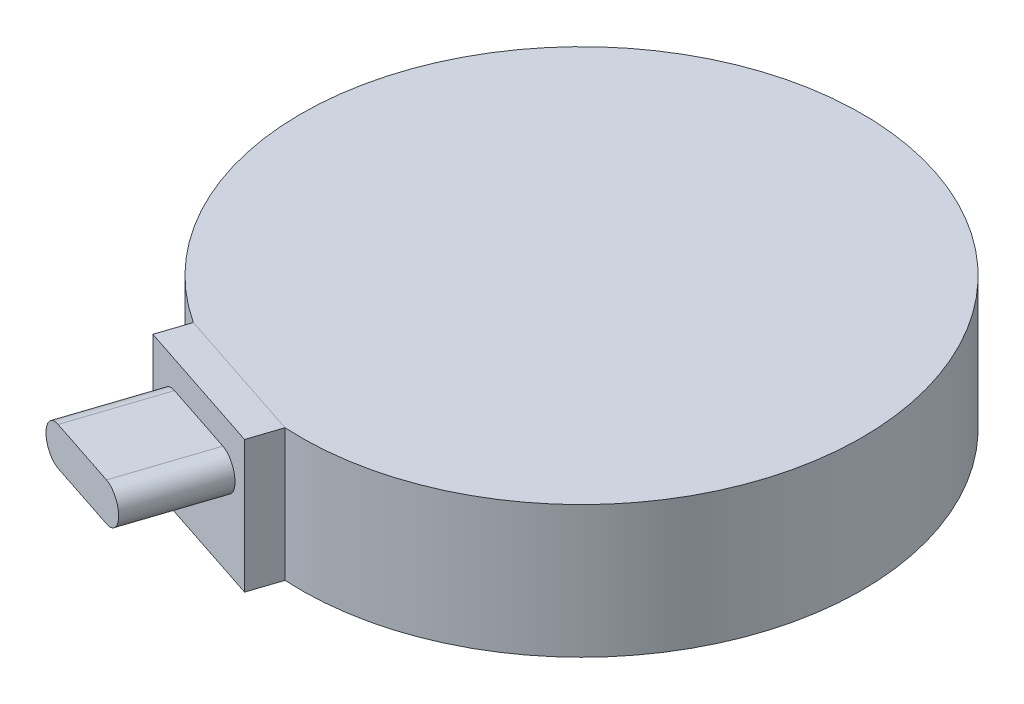
ISO-10303-21;
HEADER;
FILE_DESCRIPTION(('STEP AP214'),'2;1');
FILE_NAME('part.step','',(''),(''),'','','');
FILE_SCHEMA(('AUTOMOTIVE_DESIGN { 1 0 10303 214 1 1 1 1 }'));
ENDSEC;
DATA;
#1=APPLICATION_CONTEXT('core data for automotive mechanical design processes');
#2=APPLICATION_PROTOCOL_DEFINITION('international standard','automotive_design',2000,#1);
#3=PRODUCT_CONTEXT('',#1,'mechanical');
#4=PRODUCT('Part','Part','',(#3));
#5=PRODUCT_RELATED_PRODUCT_CATEGORY('part','',(#4));
#6=PRODUCT_DEFINITION_FORMATION('','',#4);
#7=PRODUCT_DEFINITION_CONTEXT('part definition',#1,'design');
#8=PRODUCT_DEFINITION('design','',#6,#7);
#9=PRODUCT_DEFINITION_SHAPE('','',#8);
#10=(LENGTH_UNIT() NAMED_UNIT(*) SI_UNIT(.MILLI.,.METRE.));
#11=(NAMED_UNIT(*) PLANE_ANGLE_UNIT() SI_UNIT($,.RADIAN.));
#12=(NAMED_UNIT(*) SI_UNIT($,.STERADIAN.) SOLID_ANGLE_UNIT());
#13=UNCERTAINTY_MEASURE_WITH_UNIT(LENGTH_MEASURE(1.E-05),#10,'distance_accuracy_value','');
#14=(GEOMETRIC_REPRESENTATION_CONTEXT(3) GLOBAL_UNCERTAINTY_ASSIGNED_CONTEXT((#13)) GLOBAL_UNIT_ASSIGNED_CONTEXT((#10,
#11,#12)) REPRESENTATION_CONTEXT('',''));
#15=CARTESIAN_POINT('',(0.,0.,0.));
#16=DIRECTION('',(0.,0.,1.));
#17=DIRECTION('',(1.,0.,0.));
#18=AXIS2_PLACEMENT_3D('',#15,#16,#17);
#19=CARTESIAN_POINT('',(0.,33.,0.));
#20=DIRECTION('',(0.,-1.,0.));
#21=DIRECTION('',(0.,0.,-1.));
#22=AXIS2_PLACEMENT_3D('',#19,#20,#21);
#23=CYLINDRICAL_SURFACE('',#22,70.);
#24=DIRECTION('',(0.,-1.,0.));
#25=VECTOR('',#24,1.);
#26=CARTESIAN_POINT('',(-38.3128914110618,0.,58.5843183089485));
#27=LINE('',#26,#25);
#28=CARTESIAN_POINT('',(-38.3128914110618,33.,58.5843183089485));
#29=VERTEX_POINT('',#28);
#30=CARTESIAN_POINT('',(-38.3128914110618,0.,58.5843183089485));
#31=VERTEX_POINT('',#30);
#32=EDGE_CURVE('E159',#29,#31,#27,.T.);
#33=ORIENTED_EDGE('',*,*,#32,.F.);
#34=CARTESIAN_POINT('',(0.,33.,0.));
#35=DIRECTION('',(0.,1.,0.));
#36=DIRECTION('',(0.,0.,1.));
#37=AXIS2_PLACEMENT_3D('',#34,#35,#36);
#38=CIRCLE('',#37,70.);
#39=CARTESIAN_POINT('',(-4.13026741874176,33.,69.8780429823967));
#40=VERTEX_POINT('',#39);
#41=EDGE_CURVE('E176',#40,#29,#38,.T.);
#42=ORIENTED_EDGE('',*,*,#41,.F.);
#43=DIRECTION('',(0.,1.,0.));
#44=VECTOR('',#43,1.);
#45=CARTESIAN_POINT('',(-4.13026741874154,0.,69.8780429823967));
#46=LINE('',#45,#44);
#47=CARTESIAN_POINT('',(-4.13026741874154,0.,69.8780429823967));
#48=VERTEX_POINT('',#47);
#49=EDGE_CURVE('E155',#48,#40,#46,.T.);
#50=ORIENTED_EDGE('',*,*,#49,.F.);
#51=CARTESIAN_POINT('',(0.,0.,0.));
#52=DIRECTION('',(0.,1.,0.));
#53=DIRECTION('',(0.,0.,1.));
#54=AXIS2_PLACEMENT_3D('',#51,#52,#53);
#55=CIRCLE('',#54,70.);
#56=EDGE_CURVE('E175',#48,#31,#55,.T.);
#57=ORIENTED_EDGE('',*,*,#56,.T.);
#58=EDGE_LOOP('',(#33,#42,#50,#57));
#59=FACE_BOUND('',#58,.T.);
#60=ADVANCED_FACE('F34',(#59),#23,.T.);
#61=CARTESIAN_POINT('',(0.,33.,0.));
#62=DIRECTION('',(0.,1.,0.));
#63=DIRECTION('',(0.,0.,1.));
#64=AXIS2_PLACEMENT_3D('',#61,#62,#63);
#65=PLANE('',#64);
#66=ORIENTED_EDGE('',*,*,#41,.T.);
#67=DIRECTION('',(0.949517333120006,0.,0.313714574262452));
#68=VECTOR('',#67,1.);
#69=CARTESIAN_POINT('',(-21.2215794149017,33.,64.2311806456726));
#70=LINE('',#69,#68);
#71=EDGE_CURVE('E172',#29,#40,#70,.T.);
#72=ORIENTED_EDGE('',*,*,#71,.T.);
#73=EDGE_LOOP('',(#66,#72));
#74=FACE_BOUND('',#73,.T.);
#75=ADVANCED_FACE('F196',(#74),#65,.T.);
#76=CARTESIAN_POINT('',(0.,0.,0.));
#77=DIRECTION('',(0.,1.,0.));
#78=DIRECTION('',(0.,0.,1.));
#79=AXIS2_PLACEMENT_3D('',#76,#77,#78);
#80=PLANE('',#79);
#81=CARTESIAN_POINT('',(0.,0.,0.));
#82=DIRECTION('',(0.,1.,0.));
#83=DIRECTION('',(0.,0.,1.));
#84=AXIS2_PLACEMENT_3D('',#81,#82,#83);
#85=CIRCLE('',#84,19.3500000000001);
#86=CARTESIAN_POINT('',(0.,0.,19.3500000000001));
#87=VERTEX_POINT('',#86);
#88=EDGE_CURVE('E11',#87,#87,#85,.T.);
#89=ORIENTED_EDGE('',*,*,#88,.T.);
#90=EDGE_LOOP('',(#89));
#91=FACE_BOUND('',#90,.T.);
#92=ORIENTED_EDGE('',*,*,#56,.F.);
#93=DIRECTION('',(0.313714574262452,0.,-0.949517333120006));
#94=VECTOR('',#93,1.);
#95=CARTESIAN_POINT('',(-6.63998401284116,0.,77.4741816473568));
#96=LINE('',#95,#94);
#97=CARTESIAN_POINT('',(-6.63998401284116,0.,77.4741816473568));
#98=VERTEX_POINT('',#97);
#99=EDGE_CURVE('E154',#98,#48,#96,.T.);
#100=ORIENTED_EDGE('',*,*,#99,.F.);
#101=DIRECTION('',(0.949517333120006,0.,0.313714574262452));
#102=VECTOR('',#101,1.);
#103=CARTESIAN_POINT('',(-6.63998401284116,0.,77.4741816473568));
#104=LINE('',#103,#102);
#105=CARTESIAN_POINT('',(-40.8226080051614,0.,66.1804569739085));
#106=VERTEX_POINT('',#105);
#107=EDGE_CURVE('E152',#106,#98,#104,.T.);
#108=ORIENTED_EDGE('',*,*,#107,.F.);
#109=DIRECTION('',(0.313714574262452,0.,-0.949517333120006));
#110=VECTOR('',#109,1.);
#111=CARTESIAN_POINT('',(-40.8226080051614,0.,66.1804569739085));
#112=LINE('',#111,#110);
#113=EDGE_CURVE('E163',#106,#31,#112,.T.);
#114=ORIENTED_EDGE('',*,*,#113,.T.);
#115=EDGE_LOOP('',(#92,#100,#108,#114));
#116=FACE_BOUND('',#115,.T.);
#117=ADVANCED_FACE('F201',(#91,#116),#80,.F.);
#118=CARTESIAN_POINT('',(-6.63998401284116,0.,77.4741816473568));
#119=DIRECTION('',(-0.949517333120006,0.,-0.313714574262452));
#120=DIRECTION('',(-0.313714574262452,0.,0.949517333120006));
#121=AXIS2_PLACEMENT_3D('',#118,#119,#120);
#122=PLANE('',#121);
#123=ORIENTED_EDGE('',*,*,#49,.T.);
#124=CARTESIAN_POINT('',(-4.13026741874154,33.0033905467975,69.8780429823967));
#125=VERTEX_POINT('',#124);
#126=EDGE_CURVE('E139',#40,#125,#46,.T.);
#127=ORIENTED_EDGE('',*,*,#126,.T.);
#128=DIRECTION('',(0.313714574262452,0.,-0.949517333120006));
#129=VECTOR('',#128,1.);
#130=CARTESIAN_POINT('',(-6.63998401284116,33.0033905467975,77.4741816473568));
#131=LINE('',#130,#129);
#132=CARTESIAN_POINT('',(-6.63998401284116,33.0033905467975,77.4741816473568));
#133=VERTEX_POINT('',#132);
#134=EDGE_CURVE('E169',#133,#125,#131,.T.);
#135=ORIENTED_EDGE('',*,*,#134,.F.);
#136=DIRECTION('',(0.,1.,0.));
#137=VECTOR('',#136,1.);
#138=CARTESIAN_POINT('',(-6.63998401284116,0.,77.4741816473568));
#139=LINE('',#138,#137);
#140=EDGE_CURVE('E144',#98,#133,#139,.T.);
#141=ORIENTED_EDGE('',*,*,#140,.F.);
#142=ORIENTED_EDGE('',*,*,#99,.T.);
#143=EDGE_LOOP('',(#123,#127,#135,#141,#142));
#144=FACE_BOUND('',#143,.T.);
#145=ADVANCED_FACE('F207',(#144),#122,.F.);
#146=CARTESIAN_POINT('',(-6.63998401284116,33.0033905467975,77.4741816473568));
#147=DIRECTION('',(0.,-1.,0.));
#148=DIRECTION('',(0.,0.,-1.));
#149=AXIS2_PLACEMENT_3D('',#146,#147,#148);
#150=PLANE('',#149);
#151=DIRECTION('',(-0.949517333120006,0.,-0.313714574262452));
#152=VECTOR('',#151,1.);
#153=CARTESIAN_POINT('',(-4.13026741874154,33.0033905467975,69.8780429823967));
#154=LINE('',#153,#152);
#155=CARTESIAN_POINT('',(-38.3128914110618,33.0033905467975,58.5843183089485));
#156=VERTEX_POINT('',#155);
#157=EDGE_CURVE('E157',#125,#156,#154,.T.);
#158=ORIENTED_EDGE('',*,*,#157,.T.);
#159=DIRECTION('',(0.313714574262452,0.,-0.949517333120006));
#160=VECTOR('',#159,1.);
#161=CARTESIAN_POINT('',(-40.8226080051614,33.0033905467975,66.1804569739085));
#162=LINE('',#161,#160);
#163=CARTESIAN_POINT('',(-40.8226080051614,33.0033905467975,66.1804569739085));
#164=VERTEX_POINT('',#163);
#165=EDGE_CURVE('E166',#164,#156,#162,.T.);
#166=ORIENTED_EDGE('',*,*,#165,.F.);
#167=DIRECTION('',(-0.949517333120006,0.,-0.313714574262452));
#168=VECTOR('',#167,1.);
#169=CARTESIAN_POINT('',(-6.63998401284116,33.0033905467975,77.4741816473568));
#170=LINE('',#169,#168);
#171=EDGE_CURVE('E147',#133,#164,#170,.T.);
#172=ORIENTED_EDGE('',*,*,#171,.F.);
#173=ORIENTED_EDGE('',*,*,#134,.T.);
#174=EDGE_LOOP('',(#158,#166,#172,#173));
#175=FACE_BOUND('',#174,.T.);
#176=ADVANCED_FACE('F212',(#175),#150,.F.);
#177=CARTESIAN_POINT('',(-40.8226080051614,0.,66.1804569739085));
#178=DIRECTION('',(0.949517333120006,0.,0.313714574262452));
#179=DIRECTION('',(0.313714574262452,0.,-0.949517333120006));
#180=AXIS2_PLACEMENT_3D('',#177,#178,#179);
#181=PLANE('',#180);
#182=EDGE_CURVE('E148',#156,#29,#27,.T.);
#183=ORIENTED_EDGE('',*,*,#182,.T.);
#184=ORIENTED_EDGE('',*,*,#32,.T.);
#185=ORIENTED_EDGE('',*,*,#113,.F.);
#186=DIRECTION('',(0.,-1.,0.));
#187=VECTOR('',#186,1.);
#188=CARTESIAN_POINT('',(-40.8226080051614,0.,66.1804569739085));
#189=LINE('',#188,#187);
#190=EDGE_CURVE('E150',#164,#106,#189,.T.);
#191=ORIENTED_EDGE('',*,*,#190,.F.);
#192=ORIENTED_EDGE('',*,*,#165,.T.);
#193=EDGE_LOOP('',(#183,#184,#185,#191,#192));
#194=FACE_BOUND('',#193,.T.);
#195=ADVANCED_FACE('F216',(#194),#181,.F.);
#196=CARTESIAN_POINT('',(-23.7312960090013,0.,71.8273193106327));
#197=DIRECTION('',(-0.313714574262452,0.,0.949517333120006));
#198=DIRECTION('',(0.949517333120006,0.,0.313714574262452));
#199=AXIS2_PLACEMENT_3D('',#196,#197,#198);
#200=PLANE('',#199);
#201=CARTESIAN_POINT('',(-32.7517106736414,21.45,68.8470308551394));
#202=DIRECTION('',(0.313714574262452,0.,-0.949517333120006));
#203=DIRECTION('',(-0.949517333120006,0.,-0.313714574262452));
#204=AXIS2_PLACEMENT_3D('',#201,#202,#203);
#205=CIRCLE('',#204,4.75);
#206=CARTESIAN_POINT('',(-32.7517106736412,16.7,68.8470308551394));
#207=VERTEX_POINT('',#206);
#208=CARTESIAN_POINT('',(-32.7517106736414,26.2,68.8470308551394));
#209=VERTEX_POINT('',#208);
#210=EDGE_CURVE('E134',#207,#209,#205,.T.);
#211=ORIENTED_EDGE('',*,*,#210,.T.);
#212=DIRECTION('',(0.949517333120006,0.,0.313714574262452));
#213=VECTOR('',#212,1.);
#214=CARTESIAN_POINT('',(-32.7517106736414,26.2,68.8470308551394));
#215=LINE('',#214,#213);
#216=CARTESIAN_POINT('',(-14.7108813443612,26.2,74.807607766126));
#217=VERTEX_POINT('',#216);
#218=EDGE_CURVE('E109',#209,#217,#215,.T.);
#219=ORIENTED_EDGE('',*,*,#218,.T.);
#220=CARTESIAN_POINT('',(-14.7108813443612,21.45,74.807607766126));
#221=DIRECTION('',(-0.313714574262452,0.,0.949517333120006));
#222=DIRECTION('',(0.949517333120006,0.,0.313714574262452));
#223=AXIS2_PLACEMENT_3D('',#220,#221,#222);
#224=CIRCLE('',#223,4.75);
#225=CARTESIAN_POINT('',(-14.7108813443612,16.7,74.807607766126));
#226=VERTEX_POINT('',#225);
#227=EDGE_CURVE('E54',#226,#217,#224,.T.);
#228=ORIENTED_EDGE('',*,*,#227,.F.);
#229=DIRECTION('',(0.949517333120006,0.,0.313714574262452));
#230=VECTOR('',#229,1.);
#231=CARTESIAN_POINT('',(-32.7517106736414,16.7,68.8470308551394));
#232=LINE('',#231,#230);
#233=EDGE_CURVE('E49',#207,#226,#232,.T.);
#234=ORIENTED_EDGE('',*,*,#233,.F.);
#235=EDGE_LOOP('',(#211,#219,#228,#234));
#236=FACE_BOUND('',#235,.T.);
#237=ORIENTED_EDGE('',*,*,#140,.T.);
#238=ORIENTED_EDGE('',*,*,#171,.T.);
#239=ORIENTED_EDGE('',*,*,#190,.T.);
#240=ORIENTED_EDGE('',*,*,#107,.T.);
#241=EDGE_LOOP('',(#237,#238,#239,#240));
#242=FACE_BOUND('',#241,.T.);
#243=ADVANCED_FACE('F220',(#236,#242),#200,.T.);
#244=CARTESIAN_POINT('',(-21.2215794149017,0.,64.2311806456726));
#245=DIRECTION('',(-0.313714574262452,0.,0.949517333120006));
#246=DIRECTION('',(0.949517333120006,0.,0.313714574262452));
#247=AXIS2_PLACEMENT_3D('',#244,#245,#246);
#248=PLANE('',#247);
#249=ORIENTED_EDGE('',*,*,#71,.F.);
#250=ORIENTED_EDGE('',*,*,#182,.F.);
#251=ORIENTED_EDGE('',*,*,#157,.F.);
#252=ORIENTED_EDGE('',*,*,#126,.F.);
#253=EDGE_LOOP('',(#249,#250,#251,#252));
#254=FACE_BOUND('',#253,.T.);
#255=ADVANCED_FACE('F222',(#254),#248,.F.);
#256=CARTESIAN_POINT('',(-39.9671458816778,21.45,90.6859295168995));
#257=DIRECTION('',(0.313714574262452,0.,-0.949517333120006));
#258=DIRECTION('',(-0.949517333120006,0.,-0.313714574262452));
#259=AXIS2_PLACEMENT_3D('',#256,#257,#258);
#260=CYLINDRICAL_SURFACE('',#259,4.75);
#261=ORIENTED_EDGE('',*,*,#210,.F.);
#262=DIRECTION('',(0.313714574262452,0.,-0.949517333120006));
#263=VECTOR('',#262,1.);
#264=CARTESIAN_POINT('',(-39.9671458816778,16.7,90.6859295168995));
#265=LINE('',#264,#263);
#266=CARTESIAN_POINT('',(-39.9671458816778,16.7,90.6859295168995));
#267=VERTEX_POINT('',#266);
#268=EDGE_CURVE('E125',#267,#207,#265,.T.);
#269=ORIENTED_EDGE('',*,*,#268,.F.);
#270=CARTESIAN_POINT('',(-39.9671458816778,21.45,90.6859295168995));
#271=DIRECTION('',(0.313714574262452,0.,-0.949517333120006));
#272=DIRECTION('',(-0.949517333120006,0.,-0.313714574262452));
#273=AXIS2_PLACEMENT_3D('',#270,#271,#272);
#274=CIRCLE('',#273,4.75);
#275=CARTESIAN_POINT('',(-39.9671458816778,26.2,90.6859295168995));
#276=VERTEX_POINT('',#275);
#277=EDGE_CURVE('E119',#267,#276,#274,.T.);
#278=ORIENTED_EDGE('',*,*,#277,.T.);
#279=DIRECTION('',(0.313714574262452,0.,-0.949517333120006));
#280=VECTOR('',#279,1.);
#281=CARTESIAN_POINT('',(-39.9671458816778,26.2,90.6859295168995));
#282=LINE('',#281,#280);
#283=EDGE_CURVE('E104',#276,#209,#282,.T.);
#284=ORIENTED_EDGE('',*,*,#283,.T.);
#285=EDGE_LOOP('',(#261,#269,#278,#284));
#286=FACE_BOUND('',#285,.T.);
#287=ADVANCED_FACE('F124',(#286),#260,.T.);
#288=CARTESIAN_POINT('',(-39.9671458816778,16.7,90.6859295168995));
#289=DIRECTION('',(0.,1.,0.));
#290=DIRECTION('',(0.,0.,1.));
#291=AXIS2_PLACEMENT_3D('',#288,#289,#290);
#292=PLANE('',#291);
#293=ORIENTED_EDGE('',*,*,#233,.T.);
#294=DIRECTION('',(0.313714574262452,0.,-0.949517333120006));
#295=VECTOR('',#294,1.);
#296=CARTESIAN_POINT('',(-21.9263165523976,16.7,96.6465064278861));
#297=LINE('',#296,#295);
#298=CARTESIAN_POINT('',(-21.9263165523976,16.7,96.6465064278861));
#299=VERTEX_POINT('',#298);
#300=EDGE_CURVE('E140',#299,#226,#297,.T.);
#301=ORIENTED_EDGE('',*,*,#300,.F.);
#302=DIRECTION('',(0.949517333120006,0.,0.313714574262452));
#303=VECTOR('',#302,1.);
#304=CARTESIAN_POINT('',(-39.9671458816778,16.7,90.6859295168995));
#305=LINE('',#304,#303);
#306=EDGE_CURVE('E114',#267,#299,#305,.T.);
#307=ORIENTED_EDGE('',*,*,#306,.F.);
#308=ORIENTED_EDGE('',*,*,#268,.T.);
#309=EDGE_LOOP('',(#293,#301,#307,#308));
#310=FACE_BOUND('',#309,.T.);
#311=ADVANCED_FACE('F230',(#310),#292,.F.);
#312=CARTESIAN_POINT('',(-21.9263165523976,21.45,96.6465064278861));
#313=DIRECTION('',(0.313714574262452,0.,-0.949517333120006));
#314=DIRECTION('',(-0.949517333120006,0.,-0.313714574262452));
#315=AXIS2_PLACEMENT_3D('',#312,#313,#314);
#316=CYLINDRICAL_SURFACE('',#315,4.75);
#317=ORIENTED_EDGE('',*,*,#227,.T.);
#318=DIRECTION('',(0.313714574262452,0.,-0.949517333120006));
#319=VECTOR('',#318,1.);
#320=CARTESIAN_POINT('',(-21.9263165523976,26.2,96.6465064278861));
#321=LINE('',#320,#319);
#322=CARTESIAN_POINT('',(-21.9263165523976,26.2,96.6465064278861));
#323=VERTEX_POINT('',#322);
#324=EDGE_CURVE('E113',#323,#217,#321,.T.);
#325=ORIENTED_EDGE('',*,*,#324,.F.);
#326=CARTESIAN_POINT('',(-21.9263165523976,21.45,96.6465064278861));
#327=DIRECTION('',(-0.313714574262452,0.,0.949517333120006));
#328=DIRECTION('',(0.949517333120006,0.,0.313714574262452));
#329=AXIS2_PLACEMENT_3D('',#326,#327,#328);
#330=CIRCLE('',#329,4.75);
#331=EDGE_CURVE('E121',#299,#323,#330,.T.);
#332=ORIENTED_EDGE('',*,*,#331,.F.);
#333=ORIENTED_EDGE('',*,*,#300,.T.);
#334=EDGE_LOOP('',(#317,#325,#332,#333));
#335=FACE_BOUND('',#334,.T.);
#336=ADVANCED_FACE('F233',(#335),#316,.T.);
#337=CARTESIAN_POINT('',(-39.9671458816778,26.2,90.6859295168995));
#338=DIRECTION('',(0.,1.,0.));
#339=DIRECTION('',(0.,0.,1.));
#340=AXIS2_PLACEMENT_3D('',#337,#338,#339);
#341=PLANE('',#340);
#342=ORIENTED_EDGE('',*,*,#218,.F.);
#343=ORIENTED_EDGE('',*,*,#283,.F.);
#344=DIRECTION('',(0.949517333120006,0.,0.313714574262452));
#345=VECTOR('',#344,1.);
#346=CARTESIAN_POINT('',(-39.9671458816778,26.2,90.6859295168995));
#347=LINE('',#346,#345);
#348=EDGE_CURVE('E108',#276,#323,#347,.T.);
#349=ORIENTED_EDGE('',*,*,#348,.T.);
#350=ORIENTED_EDGE('',*,*,#324,.T.);
#351=EDGE_LOOP('',(#342,#343,#349,#350));
#352=FACE_BOUND('',#351,.T.);
#353=ADVANCED_FACE('F106',(#352),#341,.T.);
#354=CARTESIAN_POINT('',(-39.9671458816778,21.45,90.6859295168995));
#355=DIRECTION('',(0.313714574262452,0.,-0.949517333120006));
#356=DIRECTION('',(-0.949517333120006,0.,-0.313714574262452));
#357=AXIS2_PLACEMENT_3D('',#354,#355,#356);
#358=PLANE('',#357);
#359=ORIENTED_EDGE('',*,*,#277,.F.);
#360=ORIENTED_EDGE('',*,*,#306,.T.);
#361=ORIENTED_EDGE('',*,*,#331,.T.);
#362=ORIENTED_EDGE('',*,*,#348,.F.);
#363=EDGE_LOOP('',(#359,#360,#361,#362));
#364=FACE_BOUND('',#363,.T.);
#365=ADVANCED_FACE('F118',(#364),#358,.F.);
#366=CARTESIAN_POINT('',(0.,14.,0.));
#367=DIRECTION('',(0.,-1.,0.));
#368=DIRECTION('',(0.,0.,-1.));
#369=AXIS2_PLACEMENT_3D('',#366,#367,#368);
#370=CYLINDRICAL_SURFACE('',#369,13.35);
#371=CARTESIAN_POINT('',(0.,6.00000000000003,0.));
#372=DIRECTION('',(0.,1.,0.));
#373=DIRECTION('',(0.,0.,1.));
#374=AXIS2_PLACEMENT_3D('',#371,#372,#373);
#375=CIRCLE('',#374,13.35);
#376=CARTESIAN_POINT('',(0.,6.00000000000003,13.35));
#377=VERTEX_POINT('',#376);
#378=EDGE_CURVE('E42',#377,#377,#375,.F.);
#379=ORIENTED_EDGE('',*,*,#378,.T.);
#380=EDGE_LOOP('',(#379));
#381=FACE_BOUND('',#380,.T.);
#382=CARTESIAN_POINT('',(0.,14.,0.));
#383=DIRECTION('',(0.,-1.,0.));
#384=DIRECTION('',(0.,0.,-1.));
#385=AXIS2_PLACEMENT_3D('',#382,#383,#384);
#386=CIRCLE('',#385,13.35);
#387=CARTESIAN_POINT('',(0.,14.,-13.35));
#388=VERTEX_POINT('',#387);
#389=EDGE_CURVE('E130',#388,#388,#386,.T.);
#390=ORIENTED_EDGE('',*,*,#389,.F.);
#391=EDGE_LOOP('',(#390));
#392=FACE_BOUND('',#391,.T.);
#393=ADVANCED_FACE('F183',(#381,#392),#370,.F.);
#394=CARTESIAN_POINT('',(0.,14.,0.));
#395=DIRECTION('',(0.,-1.,0.));
#396=DIRECTION('',(0.,0.,-1.));
#397=AXIS2_PLACEMENT_3D('',#394,#395,#396);
#398=PLANE('',#397);
#399=ORIENTED_EDGE('',*,*,#389,.T.);
#400=EDGE_LOOP('',(#399));
#401=FACE_BOUND('',#400,.T.);
#402=ADVANCED_FACE('F187',(#401),#398,.T.);
#403=CARTESIAN_POINT('',(0.,6.00000000000003,0.));
#404=DIRECTION('',(0.,-1.,0.));
#405=DIRECTION('',(0.,0.,-1.));
#406=AXIS2_PLACEMENT_3D('',#403,#404,#405);
#407=CONICAL_SURFACE('',#406,13.35,0.785398163397451);
#408=ORIENTED_EDGE('',*,*,#88,.F.);
#409=EDGE_LOOP('',(#408));
#410=FACE_BOUND('',#409,.T.);
#411=ORIENTED_EDGE('',*,*,#378,.F.);
#412=EDGE_LOOP('',(#411));
#413=FACE_BOUND('',#412,.T.);
#414=ADVANCED_FACE('F36',(#410,#413),#407,.F.);
#415=CLOSED_SHELL('',(#60,#75,#117,#145,#176,#195,#243,#255,#287,#311,#336,#353,#365,#393,#402,#414));
#416=MANIFOLD_SOLID_BREP('B2',#415);
#417=ADVANCED_BREP_SHAPE_REPRESENTATION('',(#18,#416),#14);
#418=SHAPE_DEFINITION_REPRESENTATION(#9,#417);
ENDSEC;
END-ISO-10303-21;
